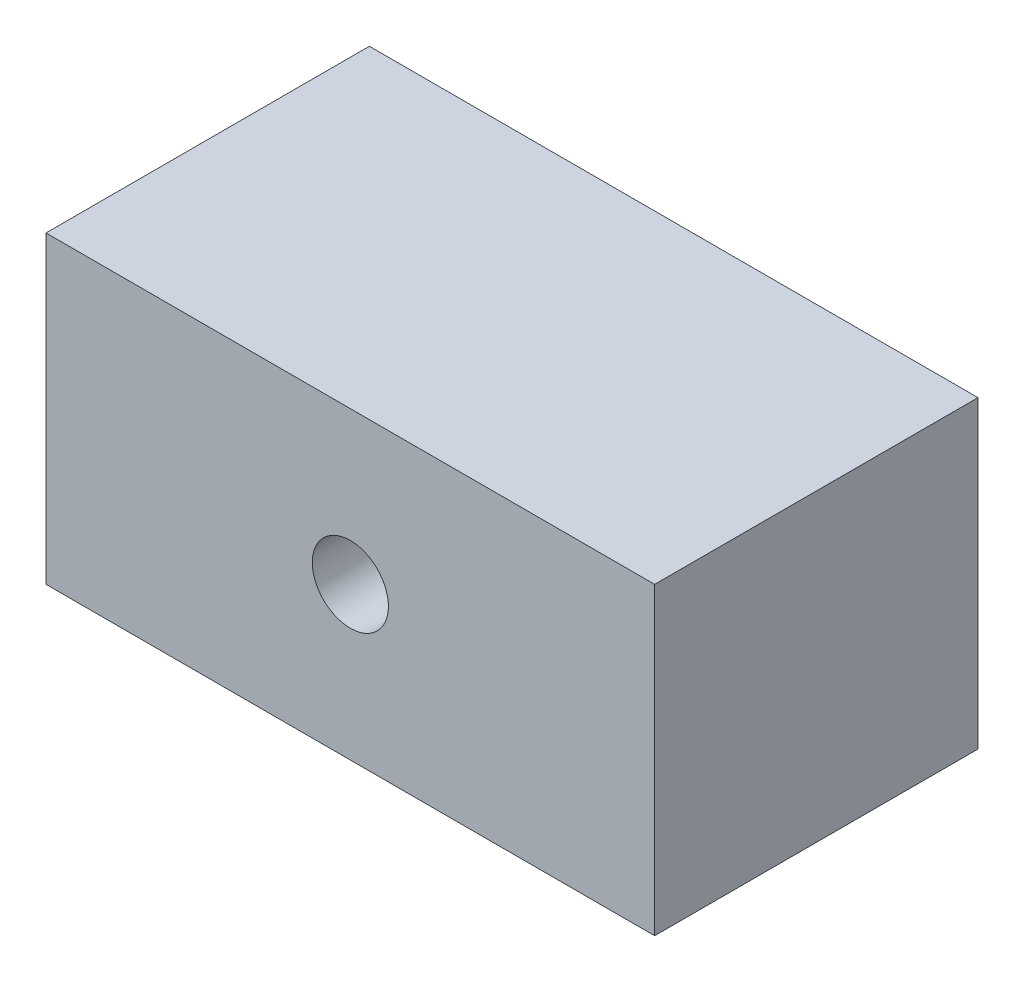
ISO-10303-21;
HEADER;
FILE_DESCRIPTION(('STEP AP214'),'2;1');
FILE_NAME('part.step','',(''),(''),'','','');
FILE_SCHEMA(('AUTOMOTIVE_DESIGN { 1 0 10303 214 1 1 1 1 }'));
ENDSEC;
DATA;
#1=APPLICATION_CONTEXT('core data for automotive mechanical design processes');
#2=APPLICATION_PROTOCOL_DEFINITION('international standard','automotive_design',2000,#1);
#3=PRODUCT_CONTEXT('',#1,'mechanical');
#4=PRODUCT('Part','Part','',(#3));
#5=PRODUCT_RELATED_PRODUCT_CATEGORY('part','',(#4));
#6=PRODUCT_DEFINITION_FORMATION('','',#4);
#7=PRODUCT_DEFINITION_CONTEXT('part definition',#1,'design');
#8=PRODUCT_DEFINITION('design','',#6,#7);
#9=PRODUCT_DEFINITION_SHAPE('','',#8);
#10=(LENGTH_UNIT() NAMED_UNIT(*) SI_UNIT(.MILLI.,.METRE.));
#11=(NAMED_UNIT(*) PLANE_ANGLE_UNIT() SI_UNIT($,.RADIAN.));
#12=(NAMED_UNIT(*) SI_UNIT($,.STERADIAN.) SOLID_ANGLE_UNIT());
#13=UNCERTAINTY_MEASURE_WITH_UNIT(LENGTH_MEASURE(1.E-05),#10,'distance_accuracy_value','');
#14=(GEOMETRIC_REPRESENTATION_CONTEXT(3) GLOBAL_UNCERTAINTY_ASSIGNED_CONTEXT((#13)) GLOBAL_UNIT_ASSIGNED_CONTEXT((#10,
#11,#12)) REPRESENTATION_CONTEXT('',''));
#15=CARTESIAN_POINT('',(0.,0.,0.));
#16=DIRECTION('',(0.,0.,1.));
#17=DIRECTION('',(1.,0.,0.));
#18=AXIS2_PLACEMENT_3D('',#15,#16,#17);
#19=CARTESIAN_POINT('',(-25.4,-12.7,-26.9875));
#20=DIRECTION('',(-1.,0.,0.));
#21=DIRECTION('',(0.,0.,1.));
#22=AXIS2_PLACEMENT_3D('',#19,#20,#21);
#23=PLANE('',#22);
#24=DIRECTION('',(0.,-1.,0.));
#25=VECTOR('',#24,1.);
#26=CARTESIAN_POINT('',(-25.4,-12.7,0.));
#27=LINE('',#26,#25);
#28=CARTESIAN_POINT('',(-25.4,12.7,0.));
#29=VERTEX_POINT('',#28);
#30=CARTESIAN_POINT('',(-25.4,-12.7,0.));
#31=VERTEX_POINT('',#30);
#32=EDGE_CURVE('E98',#29,#31,#27,.T.);
#33=ORIENTED_EDGE('',*,*,#32,.F.);
#34=DIRECTION('',(0.,0.,1.));
#35=VECTOR('',#34,1.);
#36=CARTESIAN_POINT('',(-25.4,12.7,-26.9875));
#37=LINE('',#36,#35);
#38=CARTESIAN_POINT('',(-25.4,12.7,-26.9875));
#39=VERTEX_POINT('',#38);
#40=EDGE_CURVE('E11',#39,#29,#37,.T.);
#41=ORIENTED_EDGE('',*,*,#40,.F.);
#42=DIRECTION('',(0.,-1.,0.));
#43=VECTOR('',#42,1.);
#44=CARTESIAN_POINT('',(-25.4,-12.7,-26.9875));
#45=LINE('',#44,#43);
#46=CARTESIAN_POINT('',(-25.4,-12.7,-26.9875));
#47=VERTEX_POINT('',#46);
#48=EDGE_CURVE('E91',#39,#47,#45,.T.);
#49=ORIENTED_EDGE('',*,*,#48,.T.);
#50=DIRECTION('',(0.,0.,1.));
#51=VECTOR('',#50,1.);
#52=CARTESIAN_POINT('',(-25.4,-12.7,-26.9875));
#53=LINE('',#52,#51);
#54=EDGE_CURVE('E36',#47,#31,#53,.T.);
#55=ORIENTED_EDGE('',*,*,#54,.T.);
#56=EDGE_LOOP('',(#33,#41,#49,#55));
#57=FACE_BOUND('',#56,.T.);
#58=ADVANCED_FACE('F33',(#57),#23,.T.);
#59=CARTESIAN_POINT('',(25.4,12.7,-26.9875));
#60=DIRECTION('',(0.,1.,0.));
#61=DIRECTION('',(-1.,0.,0.));
#62=AXIS2_PLACEMENT_3D('',#59,#60,#61);
#63=PLANE('',#62);
#64=DIRECTION('',(-1.,0.,0.));
#65=VECTOR('',#64,1.);
#66=CARTESIAN_POINT('',(25.4,12.7,0.));
#67=LINE('',#66,#65);
#68=CARTESIAN_POINT('',(25.4,12.7,0.));
#69=VERTEX_POINT('',#68);
#70=EDGE_CURVE('E93',#69,#29,#67,.T.);
#71=ORIENTED_EDGE('',*,*,#70,.F.);
#72=DIRECTION('',(0.,0.,1.));
#73=VECTOR('',#72,1.);
#74=CARTESIAN_POINT('',(25.4,12.7,-26.9875));
#75=LINE('',#74,#73);
#76=CARTESIAN_POINT('',(25.4,12.7,-26.9875));
#77=VERTEX_POINT('',#76);
#78=EDGE_CURVE('E42',#77,#69,#75,.T.);
#79=ORIENTED_EDGE('',*,*,#78,.F.);
#80=DIRECTION('',(-1.,0.,0.));
#81=VECTOR('',#80,1.);
#82=CARTESIAN_POINT('',(25.4,12.7,-26.9875));
#83=LINE('',#82,#81);
#84=EDGE_CURVE('E88',#77,#39,#83,.T.);
#85=ORIENTED_EDGE('',*,*,#84,.T.);
#86=ORIENTED_EDGE('',*,*,#40,.T.);
#87=EDGE_LOOP('',(#71,#79,#85,#86));
#88=FACE_BOUND('',#87,.T.);
#89=ADVANCED_FACE('F109',(#88),#63,.T.);
#90=CARTESIAN_POINT('',(25.4,-12.7,-26.9875));
#91=DIRECTION('',(1.,0.,0.));
#92=DIRECTION('',(0.,0.,-1.));
#93=AXIS2_PLACEMENT_3D('',#90,#91,#92);
#94=PLANE('',#93);
#95=DIRECTION('',(0.,1.,0.));
#96=VECTOR('',#95,1.);
#97=CARTESIAN_POINT('',(25.4,-12.7,0.));
#98=LINE('',#97,#96);
#99=CARTESIAN_POINT('',(25.4,-12.7,0.));
#100=VERTEX_POINT('',#99);
#101=EDGE_CURVE('E83',#100,#69,#98,.T.);
#102=ORIENTED_EDGE('',*,*,#101,.F.);
#103=DIRECTION('',(0.,0.,1.));
#104=VECTOR('',#103,1.);
#105=CARTESIAN_POINT('',(25.4,-12.7,-26.9875));
#106=LINE('',#105,#104);
#107=CARTESIAN_POINT('',(25.4,-12.7,-26.9875));
#108=VERTEX_POINT('',#107);
#109=EDGE_CURVE('E78',#108,#100,#106,.T.);
#110=ORIENTED_EDGE('',*,*,#109,.F.);
#111=DIRECTION('',(0.,1.,0.));
#112=VECTOR('',#111,1.);
#113=CARTESIAN_POINT('',(25.4,-12.7,-26.9875));
#114=LINE('',#113,#112);
#115=EDGE_CURVE('E81',#108,#77,#114,.T.);
#116=ORIENTED_EDGE('',*,*,#115,.T.);
#117=ORIENTED_EDGE('',*,*,#78,.T.);
#118=EDGE_LOOP('',(#102,#110,#116,#117));
#119=FACE_BOUND('',#118,.T.);
#120=ADVANCED_FACE('F80',(#119),#94,.T.);
#121=CARTESIAN_POINT('',(25.4,-12.7,-26.9875));
#122=DIRECTION('',(0.,-1.,0.));
#123=DIRECTION('',(1.,0.,0.));
#124=AXIS2_PLACEMENT_3D('',#121,#122,#123);
#125=PLANE('',#124);
#126=DIRECTION('',(1.,0.,0.));
#127=VECTOR('',#126,1.);
#128=CARTESIAN_POINT('',(25.4,-12.7,0.));
#129=LINE('',#128,#127);
#130=EDGE_CURVE('E101',#31,#100,#129,.T.);
#131=ORIENTED_EDGE('',*,*,#130,.F.);
#132=ORIENTED_EDGE('',*,*,#54,.F.);
#133=DIRECTION('',(1.,0.,0.));
#134=VECTOR('',#133,1.);
#135=CARTESIAN_POINT('',(25.4,-12.7,-26.9875));
#136=LINE('',#135,#134);
#137=EDGE_CURVE('E87',#47,#108,#136,.T.);
#138=ORIENTED_EDGE('',*,*,#137,.T.);
#139=ORIENTED_EDGE('',*,*,#109,.T.);
#140=EDGE_LOOP('',(#131,#132,#138,#139));
#141=FACE_BOUND('',#140,.T.);
#142=ADVANCED_FACE('F90',(#141),#125,.T.);
#143=CARTESIAN_POINT('',(0.,0.,-26.9875));
#144=DIRECTION('',(0.,0.,1.));
#145=DIRECTION('',(1.,0.,0.));
#146=AXIS2_PLACEMENT_3D('',#143,#144,#145);
#147=PLANE('',#146);
#148=CARTESIAN_POINT('',(0.,0.,-26.9875));
#149=DIRECTION('',(0.,0.,-1.));
#150=DIRECTION('',(-1.,0.,0.));
#151=AXIS2_PLACEMENT_3D('',#148,#149,#150);
#152=CIRCLE('',#151,7.9375);
#153=CARTESIAN_POINT('',(-7.9375,0.,-26.9875));
#154=VERTEX_POINT('',#153);
#155=EDGE_CURVE('E148',#154,#154,#152,.T.);
#156=ORIENTED_EDGE('',*,*,#155,.F.);
#157=EDGE_LOOP('',(#156));
#158=FACE_BOUND('',#157,.T.);
#159=ORIENTED_EDGE('',*,*,#48,.F.);
#160=ORIENTED_EDGE('',*,*,#84,.F.);
#161=ORIENTED_EDGE('',*,*,#115,.F.);
#162=ORIENTED_EDGE('',*,*,#137,.F.);
#163=EDGE_LOOP('',(#159,#160,#161,#162));
#164=FACE_BOUND('',#163,.T.);
#165=ADVANCED_FACE('F86',(#158,#164),#147,.F.);
#166=CARTESIAN_POINT('',(0.,0.,0.));
#167=DIRECTION('',(0.,0.,1.));
#168=DIRECTION('',(1.,0.,0.));
#169=AXIS2_PLACEMENT_3D('',#166,#167,#168);
#170=PLANE('',#169);
#171=CARTESIAN_POINT('',(0.,0.,0.));
#172=DIRECTION('',(0.,0.,-1.));
#173=DIRECTION('',(-1.,0.,0.));
#174=AXIS2_PLACEMENT_3D('',#171,#172,#173);
#175=CIRCLE('',#174,3.17499999999999);
#176=CARTESIAN_POINT('',(-3.17499999999999,0.,0.));
#177=VERTEX_POINT('',#176);
#178=EDGE_CURVE('E102',#177,#177,#175,.T.);
#179=ORIENTED_EDGE('',*,*,#178,.T.);
#180=EDGE_LOOP('',(#179));
#181=FACE_BOUND('',#180,.T.);
#182=ORIENTED_EDGE('',*,*,#32,.T.);
#183=ORIENTED_EDGE('',*,*,#130,.T.);
#184=ORIENTED_EDGE('',*,*,#101,.T.);
#185=ORIENTED_EDGE('',*,*,#70,.T.);
#186=EDGE_LOOP('',(#182,#183,#184,#185));
#187=FACE_BOUND('',#186,.T.);
#188=ADVANCED_FACE('F108',(#181,#187),#170,.T.);
#189=CARTESIAN_POINT('',(0.,0.,-26.9875));
#190=DIRECTION('',(0.,0.,-1.));
#191=DIRECTION('',(-1.,0.,0.));
#192=AXIS2_PLACEMENT_3D('',#189,#190,#191);
#193=CYLINDRICAL_SURFACE('',#192,3.175);
#194=ORIENTED_EDGE('',*,*,#178,.F.);
#195=EDGE_LOOP('',(#194));
#196=FACE_BOUND('',#195,.T.);
#197=CARTESIAN_POINT('',(0.,0.,-17.4625));
#198=DIRECTION('',(0.,0.,-1.));
#199=DIRECTION('',(-1.,0.,0.));
#200=AXIS2_PLACEMENT_3D('',#197,#198,#199);
#201=CIRCLE('',#200,3.175);
#202=CARTESIAN_POINT('',(-3.175,0.,-17.4625));
#203=VERTEX_POINT('',#202);
#204=EDGE_CURVE('E150',#203,#203,#201,.T.);
#205=ORIENTED_EDGE('',*,*,#204,.T.);
#206=EDGE_LOOP('',(#205));
#207=FACE_BOUND('',#206,.T.);
#208=ADVANCED_FACE('F127',(#196,#207),#193,.F.);
#209=CARTESIAN_POINT('',(3.175,0.,-17.4625));
#210=DIRECTION('',(0.,0.,1.));
#211=DIRECTION('',(1.,0.,0.));
#212=AXIS2_PLACEMENT_3D('',#209,#210,#211);
#213=PLANE('',#212);
#214=ORIENTED_EDGE('',*,*,#204,.F.);
#215=EDGE_LOOP('',(#214));
#216=FACE_BOUND('',#215,.T.);
#217=CARTESIAN_POINT('',(0.,0.,-17.4625));
#218=DIRECTION('',(0.,0.,-1.));
#219=DIRECTION('',(-1.,0.,0.));
#220=AXIS2_PLACEMENT_3D('',#217,#218,#219);
#221=CIRCLE('',#220,7.9375);
#222=CARTESIAN_POINT('',(-7.9375,0.,-17.4625));
#223=VERTEX_POINT('',#222);
#224=EDGE_CURVE('E146',#223,#223,#221,.T.);
#225=ORIENTED_EDGE('',*,*,#224,.T.);
#226=EDGE_LOOP('',(#225));
#227=FACE_BOUND('',#226,.T.);
#228=ADVANCED_FACE('F133',(#216,#227),#213,.F.);
#229=CARTESIAN_POINT('',(0.,0.,-26.9875));
#230=DIRECTION('',(0.,0.,-1.));
#231=DIRECTION('',(-1.,0.,0.));
#232=AXIS2_PLACEMENT_3D('',#229,#230,#231);
#233=CYLINDRICAL_SURFACE('',#232,7.9375);
#234=ORIENTED_EDGE('',*,*,#224,.F.);
#235=EDGE_LOOP('',(#234));
#236=FACE_BOUND('',#235,.T.);
#237=ORIENTED_EDGE('',*,*,#155,.T.);
#238=EDGE_LOOP('',(#237));
#239=FACE_BOUND('',#238,.T.);
#240=ADVANCED_FACE('F137',(#236,#239),#233,.F.);
#241=CLOSED_SHELL('',(#58,#89,#120,#142,#165,#188,#208,#228,#240));
#242=MANIFOLD_SOLID_BREP('B2',#241);
#243=ADVANCED_BREP_SHAPE_REPRESENTATION('',(#18,#242),#14);
#244=SHAPE_DEFINITION_REPRESENTATION(#9,#243);
ENDSEC;
END-ISO-10303-21;
